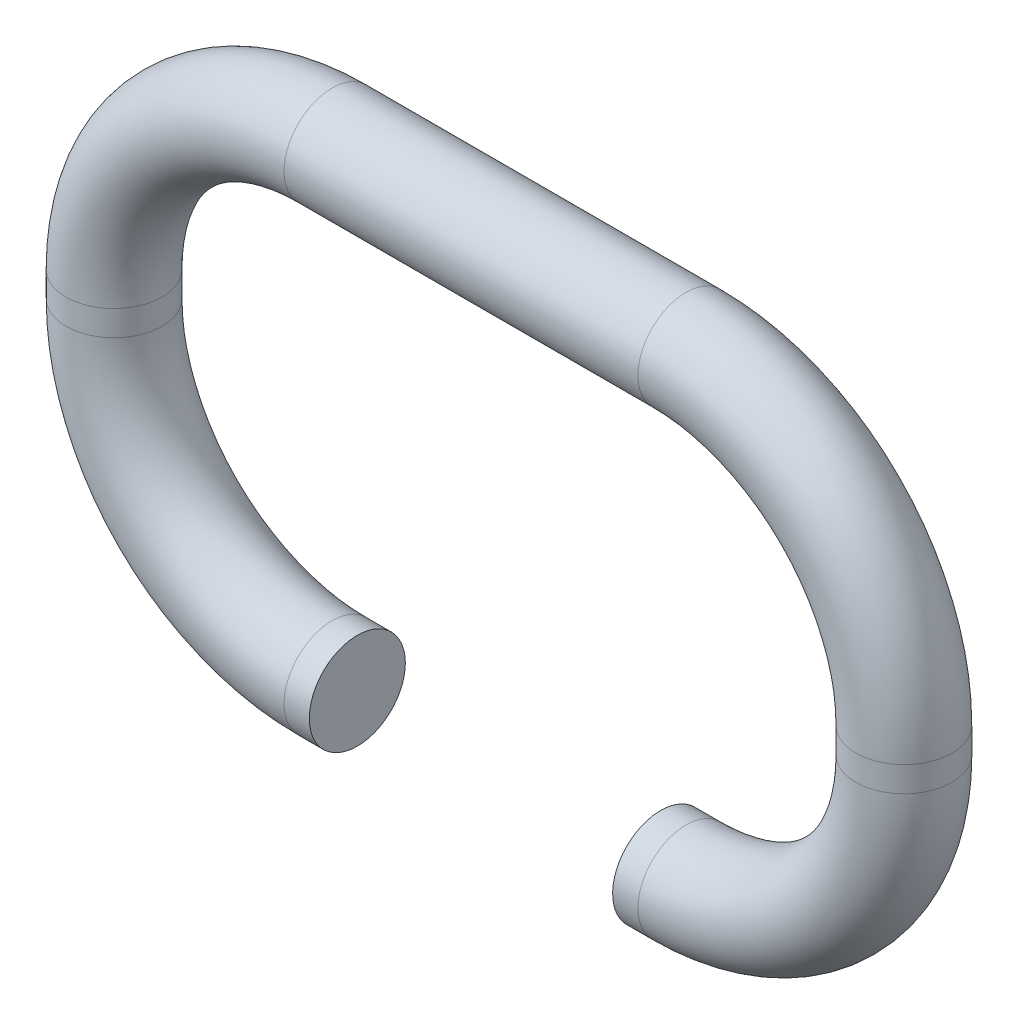
ISO-10303-21;
HEADER;
FILE_DESCRIPTION(('STEP AP214'),'2;1');
FILE_NAME('part.step','',(''),(''),'','','');
FILE_SCHEMA(('AUTOMOTIVE_DESIGN { 1 0 10303 214 1 1 1 1 }'));
ENDSEC;
DATA;
#1=APPLICATION_CONTEXT('core data for automotive mechanical design processes');
#2=APPLICATION_PROTOCOL_DEFINITION('international standard','automotive_design',2000,#1);
#3=PRODUCT_CONTEXT('',#1,'mechanical');
#4=PRODUCT('Part','Part','',(#3));
#5=PRODUCT_RELATED_PRODUCT_CATEGORY('part','',(#4));
#6=PRODUCT_DEFINITION_FORMATION('','',#4);
#7=PRODUCT_DEFINITION_CONTEXT('part definition',#1,'design');
#8=PRODUCT_DEFINITION('design','',#6,#7);
#9=PRODUCT_DEFINITION_SHAPE('','',#8);
#10=(LENGTH_UNIT() NAMED_UNIT(*) SI_UNIT(.MILLI.,.METRE.));
#11=(NAMED_UNIT(*) PLANE_ANGLE_UNIT() SI_UNIT($,.RADIAN.));
#12=(NAMED_UNIT(*) SI_UNIT($,.STERADIAN.) SOLID_ANGLE_UNIT());
#13=UNCERTAINTY_MEASURE_WITH_UNIT(LENGTH_MEASURE(1.E-05),#10,'distance_accuracy_value','');
#14=(GEOMETRIC_REPRESENTATION_CONTEXT(3) GLOBAL_UNCERTAINTY_ASSIGNED_CONTEXT((#13)) GLOBAL_UNIT_ASSIGNED_CONTEXT((#10,
#11,#12)) REPRESENTATION_CONTEXT('',''));
#15=CARTESIAN_POINT('',(0.,0.,0.));
#16=DIRECTION('',(0.,0.,1.));
#17=DIRECTION('',(1.,0.,0.));
#18=AXIS2_PLACEMENT_3D('',#15,#16,#17);
#19=CARTESIAN_POINT('',(2.,-12.6235199327048,0.));
#20=DIRECTION('',(1.,0.,0.));
#21=DIRECTION('',(0.,0.,-1.));
#22=AXIS2_PLACEMENT_3D('',#19,#20,#21);
#23=PLANE('',#22);
#24=CARTESIAN_POINT('',(2.,-12.6235199327048,0.));
#25=DIRECTION('',(1.,0.,0.));
#26=DIRECTION('',(0.,0.,-1.));
#27=AXIS2_PLACEMENT_3D('',#24,#25,#26);
#28=CIRCLE('',#27,1.9);
#29=CARTESIAN_POINT('',(2.,-12.6235199327048,-1.9));
#30=VERTEX_POINT('',#29);
#31=EDGE_CURVE('E80',#30,#30,#28,.T.);
#32=ORIENTED_EDGE('',*,*,#31,.T.);
#33=EDGE_LOOP('',(#32));
#34=FACE_BOUND('',#33,.T.);
#35=ADVANCED_FACE('F37',(#34),#23,.T.);
#36=CARTESIAN_POINT('',(14.,-12.6235199327048,0.));
#37=DIRECTION('',(1.,0.,0.));
#38=DIRECTION('',(0.,0.,-1.));
#39=AXIS2_PLACEMENT_3D('',#36,#37,#38);
#40=PLANE('',#39);
#41=CARTESIAN_POINT('',(14.,-12.6235199327048,0.));
#42=DIRECTION('',(1.,0.,0.));
#43=DIRECTION('',(0.,0.,-1.));
#44=AXIS2_PLACEMENT_3D('',#41,#42,#43);
#45=CIRCLE('',#44,1.9);
#46=CARTESIAN_POINT('',(14.,-12.6235199327048,-1.9));
#47=VERTEX_POINT('',#46);
#48=EDGE_CURVE('E10',#47,#47,#45,.T.);
#49=ORIENTED_EDGE('',*,*,#48,.F.);
#50=EDGE_LOOP('',(#49));
#51=FACE_BOUND('',#50,.T.);
#52=ADVANCED_FACE('F89',(#51),#40,.F.);
#53=CARTESIAN_POINT('',(2.,-12.6235199327048,0.));
#54=DIRECTION('',(-1.,0.,0.));
#55=DIRECTION('',(0.,0.,1.));
#56=AXIS2_PLACEMENT_3D('',#53,#54,#55);
#57=CYLINDRICAL_SURFACE('',#56,1.9);
#58=CARTESIAN_POINT('',(1.,-12.6235199327048,0.));
#59=DIRECTION('',(1.,0.,0.));
#60=DIRECTION('',(0.,0.,-1.));
#61=AXIS2_PLACEMENT_3D('',#58,#59,#60);
#62=CIRCLE('',#61,1.9);
#63=CARTESIAN_POINT('',(1.,-14.5235199327048,0.));
#64=VERTEX_POINT('',#63);
#65=EDGE_CURVE('E76',#64,#64,#62,.T.);
#66=ORIENTED_EDGE('',*,*,#65,.T.);
#67=EDGE_LOOP('',(#66));
#68=FACE_BOUND('',#67,.T.);
#69=ORIENTED_EDGE('',*,*,#31,.F.);
#70=EDGE_LOOP('',(#69));
#71=FACE_BOUND('',#70,.T.);
#72=ADVANCED_FACE('F86',(#68,#71),#57,.T.);
#73=CARTESIAN_POINT('',(1.,-4.,0.));
#74=DIRECTION('',(0.,0.,-1.));
#75=DIRECTION('',(-1.,0.,0.));
#76=AXIS2_PLACEMENT_3D('',#73,#74,#75);
#77=TOROIDAL_SURFACE('',#76,8.62351993270478,1.9);
#78=CARTESIAN_POINT('',(-7.62351993270478,-4.,0.));
#79=DIRECTION('',(0.,-1.,0.));
#80=DIRECTION('',(0.,0.,-1.));
#81=AXIS2_PLACEMENT_3D('',#78,#79,#80);
#82=CIRCLE('',#81,1.9);
#83=CARTESIAN_POINT('',(-9.52351993270478,-4.,0.));
#84=VERTEX_POINT('',#83);
#85=EDGE_CURVE('E72',#84,#84,#82,.T.);
#86=CARTESIAN_POINT('',(1.,-4.,0.));
#87=DIRECTION('',(0.,0.,-1.));
#88=DIRECTION('',(-1.,0.,0.));
#89=AXIS2_PLACEMENT_3D('',#86,#87,#88);
#90=CIRCLE('',#89,10.5235199327048);
#91=EDGE_CURVE('',#64,#84,#90,.T.);
#92=ORIENTED_EDGE('',*,*,#65,.F.);
#93=ORIENTED_EDGE('',*,*,#85,.T.);
#94=ORIENTED_EDGE('',*,*,#91,.T.);
#95=ORIENTED_EDGE('',*,*,#91,.F.);
#96=EDGE_LOOP('',(#92,#94,#93,#95));
#97=FACE_BOUND('',#96,.T.);
#98=ADVANCED_FACE('F88',(#97),#77,.T.);
#99=CARTESIAN_POINT('',(-7.62351993270478,-4.,0.));
#100=DIRECTION('',(0.,1.,0.));
#101=DIRECTION('',(-1.,0.,0.));
#102=AXIS2_PLACEMENT_3D('',#99,#100,#101);
#103=CYLINDRICAL_SURFACE('',#102,1.9);
#104=CARTESIAN_POINT('',(-7.62351993270478,-3.00000000000002,0.));
#105=DIRECTION('',(0.,-1.,0.));
#106=DIRECTION('',(0.,0.,-1.));
#107=AXIS2_PLACEMENT_3D('',#104,#105,#106);
#108=CIRCLE('',#107,1.9);
#109=CARTESIAN_POINT('',(-9.52351993270478,-3.00000000000002,0.));
#110=VERTEX_POINT('',#109);
#111=EDGE_CURVE('E68',#110,#110,#108,.T.);
#112=ORIENTED_EDGE('',*,*,#111,.T.);
#113=EDGE_LOOP('',(#112));
#114=FACE_BOUND('',#113,.T.);
#115=ORIENTED_EDGE('',*,*,#85,.F.);
#116=EDGE_LOOP('',(#115));
#117=FACE_BOUND('',#116,.T.);
#118=ADVANCED_FACE('F96',(#114,#117),#103,.T.);
#119=CARTESIAN_POINT('',(1.,-3.00000000000001,0.));
#120=DIRECTION('',(0.,0.,-1.));
#121=DIRECTION('',(-1.,0.,0.));
#122=AXIS2_PLACEMENT_3D('',#119,#120,#121);
#123=TOROIDAL_SURFACE('',#122,8.62351993270478,1.9);
#124=CARTESIAN_POINT('',(1.00000000000005,5.62351993270477,0.));
#125=DIRECTION('',(-1.,0.,0.));
#126=DIRECTION('',(0.,0.,-1.));
#127=AXIS2_PLACEMENT_3D('',#124,#125,#126);
#128=CIRCLE('',#127,1.9);
#129=CARTESIAN_POINT('',(1.00000000000006,7.52351993270477,0.));
#130=VERTEX_POINT('',#129);
#131=EDGE_CURVE('E64',#130,#130,#128,.T.);
#132=CARTESIAN_POINT('',(1.,-3.00000000000001,0.));
#133=DIRECTION('',(0.,0.,-1.));
#134=DIRECTION('',(-1.,0.,0.));
#135=AXIS2_PLACEMENT_3D('',#132,#133,#134);
#136=CIRCLE('',#135,10.5235199327048);
#137=EDGE_CURVE('',#110,#130,#136,.T.);
#138=ORIENTED_EDGE('',*,*,#111,.F.);
#139=ORIENTED_EDGE('',*,*,#131,.T.);
#140=ORIENTED_EDGE('',*,*,#137,.T.);
#141=ORIENTED_EDGE('',*,*,#137,.F.);
#142=EDGE_LOOP('',(#138,#140,#139,#141));
#143=FACE_BOUND('',#142,.T.);
#144=ADVANCED_FACE('F121',(#143),#123,.T.);
#145=CARTESIAN_POINT('',(0.999999999999999,5.62351993270477,0.));
#146=DIRECTION('',(1.,0.,0.));
#147=DIRECTION('',(0.,1.,0.));
#148=AXIS2_PLACEMENT_3D('',#145,#146,#147);
#149=CYLINDRICAL_SURFACE('',#148,1.9);
#150=CARTESIAN_POINT('',(15.,5.62351993270478,0.));
#151=DIRECTION('',(-1.,0.,0.));
#152=DIRECTION('',(0.,0.,-1.));
#153=AXIS2_PLACEMENT_3D('',#150,#151,#152);
#154=CIRCLE('',#153,1.9);
#155=CARTESIAN_POINT('',(15.,7.52351993270478,0.));
#156=VERTEX_POINT('',#155);
#157=EDGE_CURVE('E60',#156,#156,#154,.T.);
#158=ORIENTED_EDGE('',*,*,#157,.T.);
#159=EDGE_LOOP('',(#158));
#160=FACE_BOUND('',#159,.T.);
#161=ORIENTED_EDGE('',*,*,#131,.F.);
#162=EDGE_LOOP('',(#161));
#163=FACE_BOUND('',#162,.T.);
#164=ADVANCED_FACE('F117',(#160,#163),#149,.T.);
#165=CARTESIAN_POINT('',(15.,-3.,0.));
#166=DIRECTION('',(0.,0.,-1.));
#167=DIRECTION('',(-1.,0.,0.));
#168=AXIS2_PLACEMENT_3D('',#165,#166,#167);
#169=TOROIDAL_SURFACE('',#168,8.62351993270478,1.9);
#170=CARTESIAN_POINT('',(23.6235199327048,-3.,0.));
#171=DIRECTION('',(0.,1.,0.));
#172=DIRECTION('',(0.,0.,-1.));
#173=AXIS2_PLACEMENT_3D('',#170,#171,#172);
#174=CIRCLE('',#173,1.9);
#175=CARTESIAN_POINT('',(25.5235199327048,-3.,0.));
#176=VERTEX_POINT('',#175);
#177=EDGE_CURVE('E54',#176,#176,#174,.T.);
#178=CARTESIAN_POINT('',(15.,-3.,0.));
#179=DIRECTION('',(0.,0.,-1.));
#180=DIRECTION('',(-1.,0.,0.));
#181=AXIS2_PLACEMENT_3D('',#178,#179,#180);
#182=CIRCLE('',#181,10.5235199327048);
#183=EDGE_CURVE('',#156,#176,#182,.T.);
#184=ORIENTED_EDGE('',*,*,#157,.F.);
#185=ORIENTED_EDGE('',*,*,#177,.T.);
#186=ORIENTED_EDGE('',*,*,#183,.T.);
#187=ORIENTED_EDGE('',*,*,#183,.F.);
#188=EDGE_LOOP('',(#184,#186,#185,#187));
#189=FACE_BOUND('',#188,.T.);
#190=ADVANCED_FACE('F113',(#189),#169,.T.);
#191=CARTESIAN_POINT('',(23.6235199327048,-3.00000000000001,0.));
#192=DIRECTION('',(0.,-1.,0.));
#193=DIRECTION('',(0.,0.,-1.));
#194=AXIS2_PLACEMENT_3D('',#191,#192,#193);
#195=CYLINDRICAL_SURFACE('',#194,1.9);
#196=CARTESIAN_POINT('',(23.6235199327048,-4.,0.));
#197=DIRECTION('',(0.,1.,0.));
#198=DIRECTION('',(0.,0.,-1.));
#199=AXIS2_PLACEMENT_3D('',#196,#197,#198);
#200=CIRCLE('',#199,1.9);
#201=CARTESIAN_POINT('',(25.5235199327048,-4.,0.));
#202=VERTEX_POINT('',#201);
#203=EDGE_CURVE('E49',#202,#202,#200,.T.);
#204=ORIENTED_EDGE('',*,*,#203,.T.);
#205=EDGE_LOOP('',(#204));
#206=FACE_BOUND('',#205,.T.);
#207=ORIENTED_EDGE('',*,*,#177,.F.);
#208=EDGE_LOOP('',(#207));
#209=FACE_BOUND('',#208,.T.);
#210=ADVANCED_FACE('F107',(#206,#209),#195,.T.);
#211=CARTESIAN_POINT('',(15.,-4.,0.));
#212=DIRECTION('',(0.,0.,-1.));
#213=DIRECTION('',(-1.,0.,0.));
#214=AXIS2_PLACEMENT_3D('',#211,#212,#213);
#215=TOROIDAL_SURFACE('',#214,8.62351993270478,1.9);
#216=CARTESIAN_POINT('',(15.,-12.6235199327048,0.));
#217=DIRECTION('',(1.,0.,0.));
#218=DIRECTION('',(0.,0.,-1.));
#219=AXIS2_PLACEMENT_3D('',#216,#217,#218);
#220=CIRCLE('',#219,1.9);
#221=CARTESIAN_POINT('',(15.,-14.5235199327048,0.));
#222=VERTEX_POINT('',#221);
#223=EDGE_CURVE('E44',#222,#222,#220,.T.);
#224=CARTESIAN_POINT('',(15.,-4.,0.));
#225=DIRECTION('',(0.,0.,-1.));
#226=DIRECTION('',(-1.,0.,0.));
#227=AXIS2_PLACEMENT_3D('',#224,#225,#226);
#228=CIRCLE('',#227,10.5235199327048);
#229=EDGE_CURVE('',#202,#222,#228,.T.);
#230=ORIENTED_EDGE('',*,*,#203,.F.);
#231=ORIENTED_EDGE('',*,*,#223,.T.);
#232=ORIENTED_EDGE('',*,*,#229,.T.);
#233=ORIENTED_EDGE('',*,*,#229,.F.);
#234=EDGE_LOOP('',(#230,#232,#231,#233));
#235=FACE_BOUND('',#234,.T.);
#236=ADVANCED_FACE('F102',(#235),#215,.T.);
#237=CARTESIAN_POINT('',(15.,-12.6235199327048,0.));
#238=DIRECTION('',(-1.,0.,0.));
#239=DIRECTION('',(0.,-1.,0.));
#240=AXIS2_PLACEMENT_3D('',#237,#238,#239);
#241=CYLINDRICAL_SURFACE('',#240,1.9);
#242=ORIENTED_EDGE('',*,*,#48,.T.);
#243=EDGE_LOOP('',(#242));
#244=FACE_BOUND('',#243,.T.);
#245=ORIENTED_EDGE('',*,*,#223,.F.);
#246=EDGE_LOOP('',(#245));
#247=FACE_BOUND('',#246,.T.);
#248=ADVANCED_FACE('F100',(#244,#247),#241,.T.);
#249=CLOSED_SHELL('',(#35,#52,#72,#98,#118,#144,#164,#190,#210,#236,#248));
#250=MANIFOLD_SOLID_BREP('B2',#249);
#251=ADVANCED_BREP_SHAPE_REPRESENTATION('',(#18,#250),#14);
#252=SHAPE_DEFINITION_REPRESENTATION(#9,#251);
ENDSEC;
END-ISO-10303-21;
